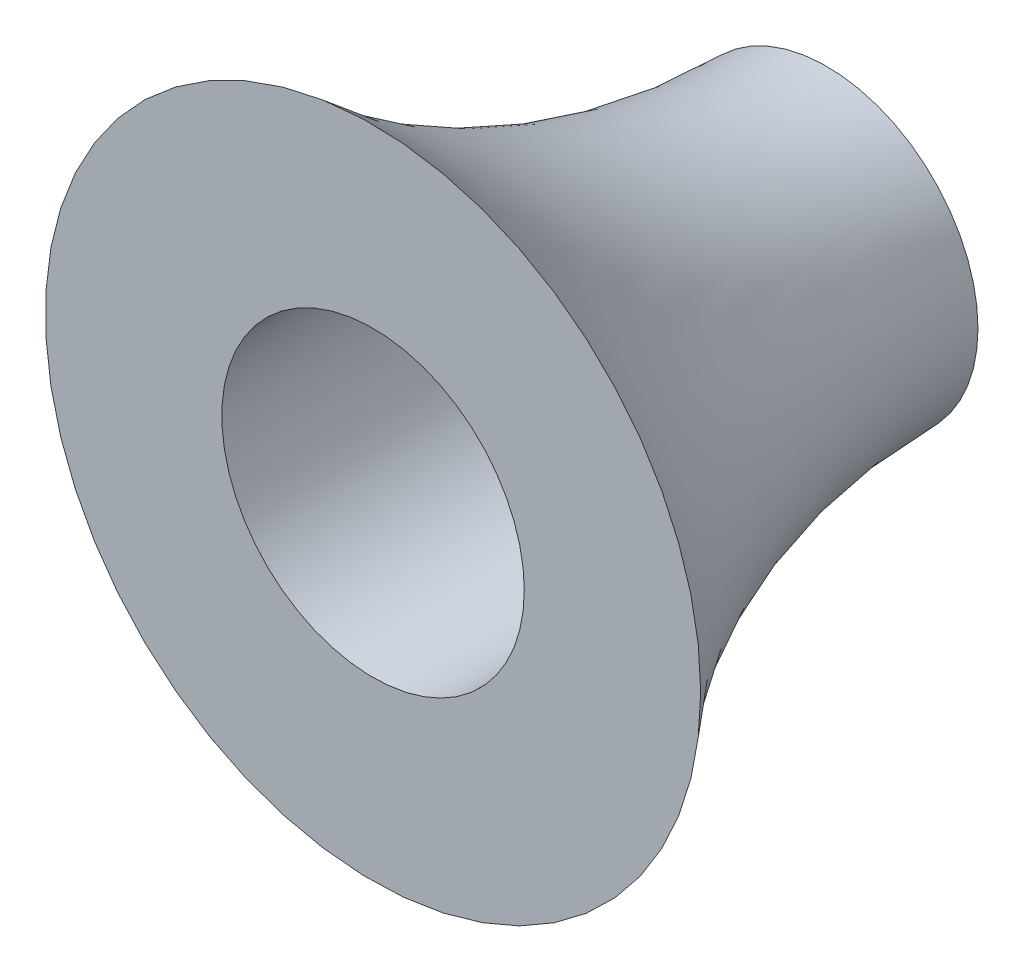
ISO-10303-21;
HEADER;
FILE_DESCRIPTION(('STEP AP214'),'2;1');
FILE_NAME('part.step','',(''),(''),'','','');
FILE_SCHEMA(('AUTOMOTIVE_DESIGN { 1 0 10303 214 1 1 1 1 }'));
ENDSEC;
DATA;
#1=APPLICATION_CONTEXT('core data for automotive mechanical design processes');
#2=APPLICATION_PROTOCOL_DEFINITION('international standard','automotive_design',2000,#1);
#3=PRODUCT_CONTEXT('',#1,'mechanical');
#4=PRODUCT('Part','Part','',(#3));
#5=PRODUCT_RELATED_PRODUCT_CATEGORY('part','',(#4));
#6=PRODUCT_DEFINITION_FORMATION('','',#4);
#7=PRODUCT_DEFINITION_CONTEXT('part definition',#1,'design');
#8=PRODUCT_DEFINITION('design','',#6,#7);
#9=PRODUCT_DEFINITION_SHAPE('','',#8);
#10=(LENGTH_UNIT() NAMED_UNIT(*) SI_UNIT(.MILLI.,.METRE.));
#11=(NAMED_UNIT(*) PLANE_ANGLE_UNIT() SI_UNIT($,.RADIAN.));
#12=(NAMED_UNIT(*) SI_UNIT($,.STERADIAN.) SOLID_ANGLE_UNIT());
#13=UNCERTAINTY_MEASURE_WITH_UNIT(LENGTH_MEASURE(1.E-05),#10,'distance_accuracy_value','');
#14=(GEOMETRIC_REPRESENTATION_CONTEXT(3) GLOBAL_UNCERTAINTY_ASSIGNED_CONTEXT((#13)) GLOBAL_UNIT_ASSIGNED_CONTEXT((#10,
#11,#12)) REPRESENTATION_CONTEXT('',''));
#15=CARTESIAN_POINT('',(0.,0.,0.));
#16=DIRECTION('',(0.,0.,1.));
#17=DIRECTION('',(1.,0.,0.));
#18=AXIS2_PLACEMENT_3D('',#15,#16,#17);
#19=CARTESIAN_POINT('',(0.341944734678672,3.31694473467867,-7.02));
#20=DIRECTION('',(0.,0.,1.));
#21=DIRECTION('',(1.,0.,0.));
#22=AXIS2_PLACEMENT_3D('',#19,#20,#21);
#23=PLANE('',#22);
#24=CARTESIAN_POINT('',(1.225,4.2,-7.02));
#25=DIRECTION('',(0.,0.,1.));
#26=DIRECTION('',(1.,0.,0.));
#27=AXIS2_PLACEMENT_3D('',#24,#25,#26);
#28=CIRCLE('',#27,0.299999999999998);
#29=CARTESIAN_POINT('',(1.525,4.2,-7.02));
#30=VERTEX_POINT('',#29);
#31=EDGE_CURVE('E19',#30,#30,#28,.T.);
#32=ORIENTED_EDGE('',*,*,#31,.F.);
#33=EDGE_LOOP('',(#32));
#34=FACE_BOUND('',#33,.T.);
#35=CARTESIAN_POINT('',(1.225,4.2,-7.02000000000018));
#36=DIRECTION('',(0.,0.,1.));
#37=DIRECTION('',(1.,0.,0.));
#38=AXIS2_PLACEMENT_3D('',#35,#36,#37);
#39=CIRCLE('',#38,0.650000000000852);
#40=CARTESIAN_POINT('',(1.87500000000086,4.2,-7.02000000000018));
#41=VERTEX_POINT('',#40);
#42=EDGE_CURVE('E23',#41,#41,#39,.F.);
#43=ORIENTED_EDGE('',*,*,#42,.F.);
#44=EDGE_LOOP('',(#43));
#45=FACE_BOUND('',#44,.T.);
#46=ADVANCED_FACE('F15',(#34,#45),#23,.T.);
#47=CARTESIAN_POINT('',(1.225,4.2,-7.92));
#48=DIRECTION('',(0.,0.,1.));
#49=DIRECTION('',(1.,0.,0.));
#50=AXIS2_PLACEMENT_3D('',#47,#48,#49);
#51=CYLINDRICAL_SURFACE('',#50,0.299999999999998);
#52=ORIENTED_EDGE('',*,*,#31,.T.);
#53=EDGE_LOOP('',(#52));
#54=FACE_BOUND('',#53,.T.);
#55=CARTESIAN_POINT('',(1.225,4.2,-7.92));
#56=DIRECTION('',(0.,0.,1.));
#57=DIRECTION('',(1.,0.,0.));
#58=AXIS2_PLACEMENT_3D('',#55,#56,#57);
#59=CIRCLE('',#58,0.299999999999998);
#60=CARTESIAN_POINT('',(1.525,4.2,-7.92));
#61=VERTEX_POINT('',#60);
#62=EDGE_CURVE('E10',#61,#61,#59,.T.);
#63=ORIENTED_EDGE('',*,*,#62,.F.);
#64=EDGE_LOOP('',(#63));
#65=FACE_BOUND('',#64,.T.);
#66=ADVANCED_FACE('F33',(#54,#65),#51,.F.);
#67=CARTESIAN_POINT('',(1.225,4.2,-7.92));
#68=DIRECTION('',(0.,0.,1.));
#69=DIRECTION('',(1.,0.,0.));
#70=AXIS2_PLACEMENT_3D('',#67,#68,#69);
#71=TOROIDAL_SURFACE('',#70,1.63214285714002,1.33214285714002);
#72=ORIENTED_EDGE('',*,*,#62,.T.);
#73=EDGE_LOOP('',(#72));
#74=FACE_BOUND('',#73,.T.);
#75=ORIENTED_EDGE('',*,*,#42,.T.);
#76=EDGE_LOOP('',(#75));
#77=FACE_BOUND('',#76,.T.);
#78=ADVANCED_FACE('F17',(#74,#77),#71,.F.);
#79=CLOSED_SHELL('',(#46,#66,#78));
#80=MANIFOLD_SOLID_BREP('B1',#79);
#81=ADVANCED_BREP_SHAPE_REPRESENTATION('',(#18,#80),#14);
#82=SHAPE_DEFINITION_REPRESENTATION(#9,#81);
ENDSEC;
END-ISO-10303-21;
